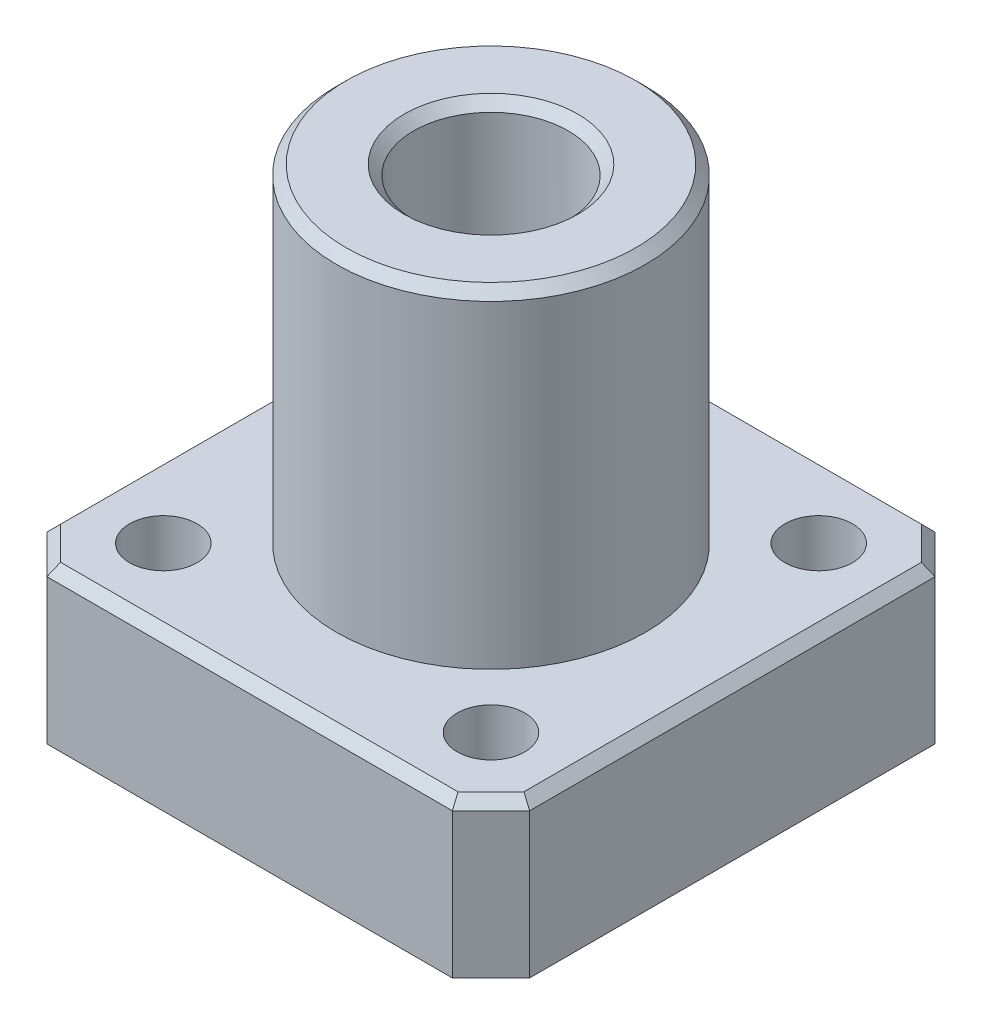
ISO-10303-21;
HEADER;
FILE_DESCRIPTION(('STEP AP214'),'2;1');
FILE_NAME('part.step','',(''),(''),'','','');
FILE_SCHEMA(('AUTOMOTIVE_DESIGN { 1 0 10303 214 1 1 1 1 }'));
ENDSEC;
DATA;
#1=APPLICATION_CONTEXT('core data for automotive mechanical design processes');
#2=APPLICATION_PROTOCOL_DEFINITION('international standard','automotive_design',2000,#1);
#3=PRODUCT_CONTEXT('',#1,'mechanical');
#4=PRODUCT('Part','Part','',(#3));
#5=PRODUCT_RELATED_PRODUCT_CATEGORY('part','',(#4));
#6=PRODUCT_DEFINITION_FORMATION('','',#4);
#7=PRODUCT_DEFINITION_CONTEXT('part definition',#1,'design');
#8=PRODUCT_DEFINITION('design','',#6,#7);
#9=PRODUCT_DEFINITION_SHAPE('','',#8);
#10=(LENGTH_UNIT() NAMED_UNIT(*) SI_UNIT(.MILLI.,.METRE.));
#11=(NAMED_UNIT(*) PLANE_ANGLE_UNIT() SI_UNIT($,.RADIAN.));
#12=(NAMED_UNIT(*) SI_UNIT($,.STERADIAN.) SOLID_ANGLE_UNIT());
#13=UNCERTAINTY_MEASURE_WITH_UNIT(LENGTH_MEASURE(1.E-05),#10,'distance_accuracy_value','');
#14=(GEOMETRIC_REPRESENTATION_CONTEXT(3) GLOBAL_UNCERTAINTY_ASSIGNED_CONTEXT((#13)) GLOBAL_UNIT_ASSIGNED_CONTEXT((#10,
#11,#12)) REPRESENTATION_CONTEXT('',''));
#15=CARTESIAN_POINT('',(0.,0.,0.));
#16=DIRECTION('',(0.,0.,1.));
#17=DIRECTION('',(1.,0.,0.));
#18=AXIS2_PLACEMENT_3D('',#15,#16,#17);
#19=CARTESIAN_POINT('',(0.,8.,-25.));
#20=DIRECTION('',(0.,-1.,0.));
#21=DIRECTION('',(0.,0.,-1.));
#22=AXIS2_PLACEMENT_3D('',#19,#20,#21);
#23=PLANE('',#22);
#24=DIRECTION('',(0.,0.,-1.));
#25=VECTOR('',#24,1.);
#26=CARTESIAN_POINT('',(24.5,8.,-25.));
#27=LINE('',#26,#25);
#28=CARTESIAN_POINT('',(24.5,8.,-2.20710678118656));
#29=VERTEX_POINT('',#28);
#30=CARTESIAN_POINT('',(24.5,8.,-22.7928932188134));
#31=VERTEX_POINT('',#30);
#32=EDGE_CURVE('E206',#29,#31,#27,.T.);
#33=ORIENTED_EDGE('',*,*,#32,.T.);
#34=DIRECTION('',(-0.707106781186547,0.,-0.707106781186548));
#35=VECTOR('',#34,1.);
#36=CARTESIAN_POINT('',(22.6464466094067,8.,-24.6464466094067));
#37=LINE('',#36,#35);
#38=CARTESIAN_POINT('',(22.7928932188134,8.,-24.5));
#39=VERTEX_POINT('',#38);
#40=EDGE_CURVE('E208',#31,#39,#37,.T.);
#41=ORIENTED_EDGE('',*,*,#40,.T.);
#42=DIRECTION('',(-1.,0.,0.));
#43=VECTOR('',#42,1.);
#44=CARTESIAN_POINT('',(0.,8.,-24.5));
#45=LINE('',#44,#43);
#46=CARTESIAN_POINT('',(2.20710678118656,8.,-24.5));
#47=VERTEX_POINT('',#46);
#48=EDGE_CURVE('E198',#39,#47,#45,.T.);
#49=ORIENTED_EDGE('',*,*,#48,.T.);
#50=DIRECTION('',(-0.707106781186548,0.,0.707106781186547));
#51=VECTOR('',#50,1.);
#52=CARTESIAN_POINT('',(0.353553390593274,8.,-22.6464466094067));
#53=LINE('',#52,#51);
#54=CARTESIAN_POINT('',(0.5,8.,-22.7928932188134));
#55=VERTEX_POINT('',#54);
#56=EDGE_CURVE('E196',#47,#55,#53,.T.);
#57=ORIENTED_EDGE('',*,*,#56,.T.);
#58=DIRECTION('',(0.,0.,1.));
#59=VECTOR('',#58,1.);
#60=CARTESIAN_POINT('',(0.5,8.,-25.));
#61=LINE('',#60,#59);
#62=CARTESIAN_POINT('',(0.5,8.,-2.20710678118656));
#63=VERTEX_POINT('',#62);
#64=EDGE_CURVE('E194',#55,#63,#61,.T.);
#65=ORIENTED_EDGE('',*,*,#64,.T.);
#66=DIRECTION('',(0.707106781186547,0.,0.707106781186548));
#67=VECTOR('',#66,1.);
#68=CARTESIAN_POINT('',(2.35355339059328,8.,-0.353553390593274));
#69=LINE('',#68,#67);
#70=CARTESIAN_POINT('',(2.20710678118656,8.,-0.500000000000001));
#71=VERTEX_POINT('',#70);
#72=EDGE_CURVE('E200',#63,#71,#69,.T.);
#73=ORIENTED_EDGE('',*,*,#72,.T.);
#74=DIRECTION('',(1.,0.,0.));
#75=VECTOR('',#74,1.);
#76=CARTESIAN_POINT('',(0.,8.,-0.5));
#77=LINE('',#76,#75);
#78=CARTESIAN_POINT('',(22.7928932188134,8.,-0.5));
#79=VERTEX_POINT('',#78);
#80=EDGE_CURVE('E202',#71,#79,#77,.T.);
#81=ORIENTED_EDGE('',*,*,#80,.T.);
#82=DIRECTION('',(0.707106781186548,0.,-0.707106781186547));
#83=VECTOR('',#82,1.);
#84=CARTESIAN_POINT('',(24.6464466094067,8.,-2.35355339059329));
#85=LINE('',#84,#83);
#86=EDGE_CURVE('E204',#79,#29,#85,.T.);
#87=ORIENTED_EDGE('',*,*,#86,.T.);
#88=EDGE_LOOP('',(#33,#41,#49,#57,#65,#73,#81,#87));
#89=FACE_BOUND('',#88,.T.);
#90=CARTESIAN_POINT('',(4.01471862576143,8.,-4.01471862576143));
#91=DIRECTION('',(0.,1.,0.));
#92=DIRECTION('',(0.,0.,-1.));
#93=AXIS2_PLACEMENT_3D('',#90,#91,#92);
#94=CIRCLE('',#93,1.75);
#95=CARTESIAN_POINT('',(4.01471862576143,8.,-5.76471862576143));
#96=VERTEX_POINT('',#95);
#97=EDGE_CURVE('E252',#96,#96,#94,.T.);
#98=ORIENTED_EDGE('',*,*,#97,.F.);
#99=EDGE_LOOP('',(#98));
#100=FACE_BOUND('',#99,.T.);
#101=CARTESIAN_POINT('',(20.9852813742386,8.,-20.9852813742386));
#102=DIRECTION('',(0.,1.,0.));
#103=DIRECTION('',(0.,0.,-1.));
#104=AXIS2_PLACEMENT_3D('',#101,#102,#103);
#105=CIRCLE('',#104,1.75);
#106=CARTESIAN_POINT('',(20.9852813742386,8.,-22.7352813742386));
#107=VERTEX_POINT('',#106);
#108=EDGE_CURVE('E266',#107,#107,#105,.T.);
#109=ORIENTED_EDGE('',*,*,#108,.F.);
#110=EDGE_LOOP('',(#109));
#111=FACE_BOUND('',#110,.T.);
#112=CARTESIAN_POINT('',(4.01471862576143,8.,-20.9852813742386));
#113=DIRECTION('',(0.,1.,0.));
#114=DIRECTION('',(0.,0.,1.));
#115=AXIS2_PLACEMENT_3D('',#112,#113,#114);
#116=CIRCLE('',#115,1.75);
#117=CARTESIAN_POINT('',(4.01471862576143,8.,-19.2352813742386));
#118=VERTEX_POINT('',#117);
#119=EDGE_CURVE('E142',#118,#118,#116,.T.);
#120=ORIENTED_EDGE('',*,*,#119,.F.);
#121=EDGE_LOOP('',(#120));
#122=FACE_BOUND('',#121,.T.);
#123=CARTESIAN_POINT('',(20.9852813742386,8.,-4.01471862576143));
#124=DIRECTION('',(0.,1.,0.));
#125=DIRECTION('',(0.,0.,1.));
#126=AXIS2_PLACEMENT_3D('',#123,#124,#125);
#127=CIRCLE('',#126,1.75);
#128=CARTESIAN_POINT('',(20.9852813742386,8.,-2.26471862576143));
#129=VERTEX_POINT('',#128);
#130=EDGE_CURVE('E260',#129,#129,#127,.T.);
#131=ORIENTED_EDGE('',*,*,#130,.F.);
#132=EDGE_LOOP('',(#131));
#133=FACE_BOUND('',#132,.T.);
#134=CARTESIAN_POINT('',(12.5,8.,-12.5));
#135=DIRECTION('',(0.,-1.,0.));
#136=DIRECTION('',(0.,0.,-1.));
#137=AXIS2_PLACEMENT_3D('',#134,#135,#136);
#138=CIRCLE('',#137,8.);
#139=CARTESIAN_POINT('',(12.5,8.,-20.5));
#140=VERTEX_POINT('',#139);
#141=EDGE_CURVE('E156',#140,#140,#138,.F.);
#142=ORIENTED_EDGE('',*,*,#141,.F.);
#143=EDGE_LOOP('',(#142));
#144=FACE_BOUND('',#143,.T.);
#145=ADVANCED_FACE('F30',(#89,#100,#111,#122,#133,#144),#23,.F.);
#146=CARTESIAN_POINT('',(0.,0.,-25.));
#147=DIRECTION('',(0.,-1.,0.));
#148=DIRECTION('',(0.,0.,-1.));
#149=AXIS2_PLACEMENT_3D('',#146,#147,#148);
#150=PLANE('',#149);
#151=CARTESIAN_POINT('',(12.5,0.,-12.5));
#152=DIRECTION('',(0.,-1.,0.));
#153=DIRECTION('',(0.,0.,-1.));
#154=AXIS2_PLACEMENT_3D('',#151,#152,#153);
#155=CIRCLE('',#154,4.50000000000001);
#156=CARTESIAN_POINT('',(12.5,0.,-17.));
#157=VERTEX_POINT('',#156);
#158=EDGE_CURVE('E191',#157,#157,#155,.F.);
#159=ORIENTED_EDGE('',*,*,#158,.T.);
#160=EDGE_LOOP('',(#159));
#161=FACE_BOUND('',#160,.T.);
#162=CARTESIAN_POINT('',(20.9852813742386,0.,-4.01471862576143));
#163=DIRECTION('',(0.,1.,0.));
#164=DIRECTION('',(0.,0.,1.));
#165=AXIS2_PLACEMENT_3D('',#162,#163,#164);
#166=CIRCLE('',#165,1.75);
#167=CARTESIAN_POINT('',(20.9852813742386,0.,-2.26471862576143));
#168=VERTEX_POINT('',#167);
#169=EDGE_CURVE('E257',#168,#168,#166,.T.);
#170=ORIENTED_EDGE('',*,*,#169,.T.);
#171=EDGE_LOOP('',(#170));
#172=FACE_BOUND('',#171,.T.);
#173=CARTESIAN_POINT('',(4.01471862576143,0.,-20.9852813742386));
#174=DIRECTION('',(0.,1.,0.));
#175=DIRECTION('',(0.,0.,1.));
#176=AXIS2_PLACEMENT_3D('',#173,#174,#175);
#177=CIRCLE('',#176,1.75);
#178=CARTESIAN_POINT('',(4.01471862576143,0.,-19.2352813742386));
#179=VERTEX_POINT('',#178);
#180=EDGE_CURVE('E148',#179,#179,#177,.T.);
#181=ORIENTED_EDGE('',*,*,#180,.T.);
#182=EDGE_LOOP('',(#181));
#183=FACE_BOUND('',#182,.T.);
#184=DIRECTION('',(0.,0.,1.));
#185=VECTOR('',#184,1.);
#186=CARTESIAN_POINT('',(0.,0.,0.));
#187=LINE('',#186,#185);
#188=CARTESIAN_POINT('',(0.,0.,-23.));
#189=VERTEX_POINT('',#188);
#190=CARTESIAN_POINT('',(0.,0.,-2.00000000000001));
#191=VERTEX_POINT('',#190);
#192=EDGE_CURVE('E122',#189,#191,#187,.T.);
#193=ORIENTED_EDGE('',*,*,#192,.F.);
#194=DIRECTION('',(-0.707106781186548,0.,0.707106781186547));
#195=VECTOR('',#194,1.);
#196=CARTESIAN_POINT('',(1.,0.,-24.));
#197=LINE('',#196,#195);
#198=CARTESIAN_POINT('',(2.00000000000001,0.,-25.));
#199=VERTEX_POINT('',#198);
#200=EDGE_CURVE('E128',#189,#199,#197,.F.);
#201=ORIENTED_EDGE('',*,*,#200,.T.);
#202=DIRECTION('',(-1.,0.,0.));
#203=VECTOR('',#202,1.);
#204=CARTESIAN_POINT('',(0.,0.,-25.));
#205=LINE('',#204,#203);
#206=CARTESIAN_POINT('',(23.,0.,-25.));
#207=VERTEX_POINT('',#206);
#208=EDGE_CURVE('E154',#207,#199,#205,.T.);
#209=ORIENTED_EDGE('',*,*,#208,.F.);
#210=DIRECTION('',(-0.707106781186547,0.,-0.707106781186548));
#211=VECTOR('',#210,1.);
#212=CARTESIAN_POINT('',(11.5,0.,-36.5));
#213=LINE('',#212,#211);
#214=CARTESIAN_POINT('',(25.,0.,-23.));
#215=VERTEX_POINT('',#214);
#216=EDGE_CURVE('E135',#207,#215,#213,.F.);
#217=ORIENTED_EDGE('',*,*,#216,.T.);
#218=DIRECTION('',(0.,0.,-1.));
#219=VECTOR('',#218,1.);
#220=CARTESIAN_POINT('',(25.,0.,0.));
#221=LINE('',#220,#219);
#222=CARTESIAN_POINT('',(25.,0.,-2.00000000000001));
#223=VERTEX_POINT('',#222);
#224=EDGE_CURVE('E145',#223,#215,#221,.T.);
#225=ORIENTED_EDGE('',*,*,#224,.F.);
#226=DIRECTION('',(0.707106781186548,0.,-0.707106781186547));
#227=VECTOR('',#226,1.);
#228=CARTESIAN_POINT('',(24.,0.,-0.999999999999987));
#229=LINE('',#228,#227);
#230=CARTESIAN_POINT('',(23.,0.,0.));
#231=VERTEX_POINT('',#230);
#232=EDGE_CURVE('E161',#223,#231,#229,.F.);
#233=ORIENTED_EDGE('',*,*,#232,.T.);
#234=DIRECTION('',(1.,0.,0.));
#235=VECTOR('',#234,1.);
#236=CARTESIAN_POINT('',(0.,0.,0.));
#237=LINE('',#236,#235);
#238=CARTESIAN_POINT('',(2.00000000000001,0.,0.));
#239=VERTEX_POINT('',#238);
#240=EDGE_CURVE('E141',#239,#231,#237,.T.);
#241=ORIENTED_EDGE('',*,*,#240,.F.);
#242=DIRECTION('',(0.707106781186547,0.,0.707106781186548));
#243=VECTOR('',#242,1.);
#244=CARTESIAN_POINT('',(-11.5,0.,-13.5));
#245=LINE('',#244,#243);
#246=EDGE_CURVE('E125',#239,#191,#245,.F.);
#247=ORIENTED_EDGE('',*,*,#246,.T.);
#248=EDGE_LOOP('',(#193,#201,#209,#217,#225,#233,#241,#247));
#249=FACE_BOUND('',#248,.T.);
#250=CARTESIAN_POINT('',(20.9852813742386,0.,-20.9852813742386));
#251=DIRECTION('',(0.,1.,0.));
#252=DIRECTION('',(0.,0.,-1.));
#253=AXIS2_PLACEMENT_3D('',#250,#251,#252);
#254=CIRCLE('',#253,1.75);
#255=CARTESIAN_POINT('',(20.9852813742386,0.,-22.7352813742386));
#256=VERTEX_POINT('',#255);
#257=EDGE_CURVE('E263',#256,#256,#254,.T.);
#258=ORIENTED_EDGE('',*,*,#257,.T.);
#259=EDGE_LOOP('',(#258));
#260=FACE_BOUND('',#259,.T.);
#261=CARTESIAN_POINT('',(4.01471862576143,0.,-4.01471862576143));
#262=DIRECTION('',(0.,1.,0.));
#263=DIRECTION('',(0.,0.,-1.));
#264=AXIS2_PLACEMENT_3D('',#261,#262,#263);
#265=CIRCLE('',#264,1.75);
#266=CARTESIAN_POINT('',(4.01471862576143,0.,-5.76471862576143));
#267=VERTEX_POINT('',#266);
#268=EDGE_CURVE('E246',#267,#267,#265,.T.);
#269=ORIENTED_EDGE('',*,*,#268,.T.);
#270=EDGE_LOOP('',(#269));
#271=FACE_BOUND('',#270,.T.);
#272=ADVANCED_FACE('F137',(#161,#172,#183,#249,#260,#271),#150,.T.);
#273=CARTESIAN_POINT('',(0.,8.,0.));
#274=DIRECTION('',(1.,0.,0.));
#275=DIRECTION('',(0.,0.,-1.));
#276=AXIS2_PLACEMENT_3D('',#273,#274,#275);
#277=PLANE('',#276);
#278=DIRECTION('',(0.,1.,0.));
#279=VECTOR('',#278,1.);
#280=CARTESIAN_POINT('',(0.,8.,-2.00000000000001));
#281=LINE('',#280,#279);
#282=CARTESIAN_POINT('',(0.,7.5,-2.00000000000001));
#283=VERTEX_POINT('',#282);
#284=EDGE_CURVE('E126',#191,#283,#281,.T.);
#285=ORIENTED_EDGE('',*,*,#284,.T.);
#286=DIRECTION('',(0.,0.,-1.));
#287=VECTOR('',#286,1.);
#288=CARTESIAN_POINT('',(0.,7.5,0.));
#289=LINE('',#288,#287);
#290=CARTESIAN_POINT('',(0.,7.5,-23.));
#291=VERTEX_POINT('',#290);
#292=EDGE_CURVE('E11',#283,#291,#289,.T.);
#293=ORIENTED_EDGE('',*,*,#292,.T.);
#294=DIRECTION('',(0.,-1.,0.));
#295=VECTOR('',#294,1.);
#296=CARTESIAN_POINT('',(0.,8.,-23.));
#297=LINE('',#296,#295);
#298=EDGE_CURVE('E118',#291,#189,#297,.T.);
#299=ORIENTED_EDGE('',*,*,#298,.T.);
#300=ORIENTED_EDGE('',*,*,#192,.T.);
#301=EDGE_LOOP('',(#285,#293,#299,#300));
#302=FACE_BOUND('',#301,.T.);
#303=ADVANCED_FACE('F120',(#302),#277,.F.);
#304=CARTESIAN_POINT('',(0.,8.,0.));
#305=DIRECTION('',(0.,0.,-1.));
#306=DIRECTION('',(-1.,0.,0.));
#307=AXIS2_PLACEMENT_3D('',#304,#305,#306);
#308=PLANE('',#307);
#309=DIRECTION('',(0.,1.,0.));
#310=VECTOR('',#309,1.);
#311=CARTESIAN_POINT('',(23.,8.,0.));
#312=LINE('',#311,#310);
#313=CARTESIAN_POINT('',(23.,7.5,0.));
#314=VERTEX_POINT('',#313);
#315=EDGE_CURVE('E173',#231,#314,#312,.T.);
#316=ORIENTED_EDGE('',*,*,#315,.T.);
#317=DIRECTION('',(-1.,0.,0.));
#318=VECTOR('',#317,1.);
#319=CARTESIAN_POINT('',(0.,7.5,0.));
#320=LINE('',#319,#318);
#321=CARTESIAN_POINT('',(2.00000000000001,7.5,0.));
#322=VERTEX_POINT('',#321);
#323=EDGE_CURVE('E218',#314,#322,#320,.T.);
#324=ORIENTED_EDGE('',*,*,#323,.T.);
#325=DIRECTION('',(0.,-1.,0.));
#326=VECTOR('',#325,1.);
#327=CARTESIAN_POINT('',(2.00000000000001,8.,0.));
#328=LINE('',#327,#326);
#329=EDGE_CURVE('E171',#322,#239,#328,.T.);
#330=ORIENTED_EDGE('',*,*,#329,.T.);
#331=ORIENTED_EDGE('',*,*,#240,.T.);
#332=EDGE_LOOP('',(#316,#324,#330,#331));
#333=FACE_BOUND('',#332,.T.);
#334=ADVANCED_FACE('F304',(#333),#308,.F.);
#335=CARTESIAN_POINT('',(25.,8.,0.));
#336=DIRECTION('',(-1.,0.,0.));
#337=DIRECTION('',(0.,0.,1.));
#338=AXIS2_PLACEMENT_3D('',#335,#336,#337);
#339=PLANE('',#338);
#340=DIRECTION('',(0.,1.,0.));
#341=VECTOR('',#340,1.);
#342=CARTESIAN_POINT('',(25.,8.,-23.));
#343=LINE('',#342,#341);
#344=CARTESIAN_POINT('',(25.,7.5,-23.));
#345=VERTEX_POINT('',#344);
#346=EDGE_CURVE('E168',#215,#345,#343,.T.);
#347=ORIENTED_EDGE('',*,*,#346,.T.);
#348=DIRECTION('',(0.,0.,1.));
#349=VECTOR('',#348,1.);
#350=CARTESIAN_POINT('',(25.,7.5,0.));
#351=LINE('',#350,#349);
#352=CARTESIAN_POINT('',(25.,7.5,-2.00000000000001));
#353=VERTEX_POINT('',#352);
#354=EDGE_CURVE('E214',#345,#353,#351,.T.);
#355=ORIENTED_EDGE('',*,*,#354,.T.);
#356=DIRECTION('',(0.,-1.,0.));
#357=VECTOR('',#356,1.);
#358=CARTESIAN_POINT('',(25.,8.,-2.00000000000001));
#359=LINE('',#358,#357);
#360=EDGE_CURVE('E166',#353,#223,#359,.T.);
#361=ORIENTED_EDGE('',*,*,#360,.T.);
#362=ORIENTED_EDGE('',*,*,#224,.T.);
#363=EDGE_LOOP('',(#347,#355,#361,#362));
#364=FACE_BOUND('',#363,.T.);
#365=ADVANCED_FACE('F300',(#364),#339,.F.);
#366=CARTESIAN_POINT('',(0.,8.,-25.));
#367=DIRECTION('',(0.,0.,1.));
#368=DIRECTION('',(1.,0.,0.));
#369=AXIS2_PLACEMENT_3D('',#366,#367,#368);
#370=PLANE('',#369);
#371=DIRECTION('',(0.,1.,0.));
#372=VECTOR('',#371,1.);
#373=CARTESIAN_POINT('',(2.00000000000001,8.,-25.));
#374=LINE('',#373,#372);
#375=CARTESIAN_POINT('',(2.00000000000001,7.5,-25.));
#376=VERTEX_POINT('',#375);
#377=EDGE_CURVE('E130',#199,#376,#374,.T.);
#378=ORIENTED_EDGE('',*,*,#377,.T.);
#379=DIRECTION('',(1.,0.,0.));
#380=VECTOR('',#379,1.);
#381=CARTESIAN_POINT('',(0.,7.5,-25.));
#382=LINE('',#381,#380);
#383=CARTESIAN_POINT('',(23.,7.5,-25.));
#384=VERTEX_POINT('',#383);
#385=EDGE_CURVE('E222',#376,#384,#382,.T.);
#386=ORIENTED_EDGE('',*,*,#385,.T.);
#387=DIRECTION('',(0.,-1.,0.));
#388=VECTOR('',#387,1.);
#389=CARTESIAN_POINT('',(23.,8.,-25.));
#390=LINE('',#389,#388);
#391=EDGE_CURVE('E134',#384,#207,#390,.T.);
#392=ORIENTED_EDGE('',*,*,#391,.T.);
#393=ORIENTED_EDGE('',*,*,#208,.T.);
#394=EDGE_LOOP('',(#378,#386,#392,#393));
#395=FACE_BOUND('',#394,.T.);
#396=ADVANCED_FACE('F285',(#395),#370,.F.);
#397=CARTESIAN_POINT('',(4.01471862576143,8.,-20.9852813742386));
#398=DIRECTION('',(0.,-1.,0.));
#399=DIRECTION('',(0.,0.,-1.));
#400=AXIS2_PLACEMENT_3D('',#397,#398,#399);
#401=CYLINDRICAL_SURFACE('',#400,1.75);
#402=ORIENTED_EDGE('',*,*,#119,.T.);
#403=EDGE_LOOP('',(#402));
#404=FACE_BOUND('',#403,.T.);
#405=ORIENTED_EDGE('',*,*,#180,.F.);
#406=EDGE_LOOP('',(#405));
#407=FACE_BOUND('',#406,.T.);
#408=ADVANCED_FACE('F275',(#404,#407),#401,.F.);
#409=CARTESIAN_POINT('',(20.9852813742386,8.,-20.9852813742386));
#410=DIRECTION('',(0.,-1.,0.));
#411=DIRECTION('',(0.,0.,-1.));
#412=AXIS2_PLACEMENT_3D('',#409,#410,#411);
#413=CYLINDRICAL_SURFACE('',#412,1.75);
#414=ORIENTED_EDGE('',*,*,#108,.T.);
#415=EDGE_LOOP('',(#414));
#416=FACE_BOUND('',#415,.T.);
#417=ORIENTED_EDGE('',*,*,#257,.F.);
#418=EDGE_LOOP('',(#417));
#419=FACE_BOUND('',#418,.T.);
#420=ADVANCED_FACE('F272',(#416,#419),#413,.F.);
#421=CARTESIAN_POINT('',(20.9852813742386,8.,-4.01471862576143));
#422=DIRECTION('',(0.,-1.,0.));
#423=DIRECTION('',(0.,0.,-1.));
#424=AXIS2_PLACEMENT_3D('',#421,#422,#423);
#425=CYLINDRICAL_SURFACE('',#424,1.75);
#426=ORIENTED_EDGE('',*,*,#130,.T.);
#427=EDGE_LOOP('',(#426));
#428=FACE_BOUND('',#427,.T.);
#429=ORIENTED_EDGE('',*,*,#169,.F.);
#430=EDGE_LOOP('',(#429));
#431=FACE_BOUND('',#430,.T.);
#432=ADVANCED_FACE('F274',(#428,#431),#425,.F.);
#433=CARTESIAN_POINT('',(4.01471862576143,8.,-4.01471862576143));
#434=DIRECTION('',(0.,-1.,0.));
#435=DIRECTION('',(0.,0.,-1.));
#436=AXIS2_PLACEMENT_3D('',#433,#434,#435);
#437=CYLINDRICAL_SURFACE('',#436,1.75);
#438=ORIENTED_EDGE('',*,*,#97,.T.);
#439=EDGE_LOOP('',(#438));
#440=FACE_BOUND('',#439,.T.);
#441=ORIENTED_EDGE('',*,*,#268,.F.);
#442=EDGE_LOOP('',(#441));
#443=FACE_BOUND('',#442,.T.);
#444=ADVANCED_FACE('F282',(#440,#443),#437,.F.);
#445=CARTESIAN_POINT('',(12.5,25.,-12.5));
#446=DIRECTION('',(0.,-1.,0.));
#447=DIRECTION('',(0.,0.,-1.));
#448=AXIS2_PLACEMENT_3D('',#445,#446,#447);
#449=CYLINDRICAL_SURFACE('',#448,8.);
#450=CARTESIAN_POINT('',(12.5,24.5,-12.5));
#451=DIRECTION('',(0.,1.,0.));
#452=DIRECTION('',(0.,0.,1.));
#453=AXIS2_PLACEMENT_3D('',#450,#451,#452);
#454=CIRCLE('',#453,8.);
#455=CARTESIAN_POINT('',(12.5,24.5,-4.5));
#456=VERTEX_POINT('',#455);
#457=EDGE_CURVE('E182',#456,#456,#454,.F.);
#458=ORIENTED_EDGE('',*,*,#457,.T.);
#459=EDGE_LOOP('',(#458));
#460=FACE_BOUND('',#459,.T.);
#461=ORIENTED_EDGE('',*,*,#141,.T.);
#462=EDGE_LOOP('',(#461));
#463=FACE_BOUND('',#462,.T.);
#464=ADVANCED_FACE('F434',(#460,#463),#449,.T.);
#465=CARTESIAN_POINT('',(12.5,25.,-12.5));
#466=DIRECTION('',(0.,1.,0.));
#467=DIRECTION('',(0.,0.,1.));
#468=AXIS2_PLACEMENT_3D('',#465,#466,#467);
#469=PLANE('',#468);
#470=CARTESIAN_POINT('',(12.5,25.,-12.5));
#471=DIRECTION('',(0.,1.,0.));
#472=DIRECTION('',(0.,0.,1.));
#473=AXIS2_PLACEMENT_3D('',#470,#471,#472);
#474=CIRCLE('',#473,7.5);
#475=CARTESIAN_POINT('',(12.5,25.,-5.));
#476=VERTEX_POINT('',#475);
#477=EDGE_CURVE('E179',#476,#476,#474,.T.);
#478=ORIENTED_EDGE('',*,*,#477,.T.);
#479=EDGE_LOOP('',(#478));
#480=FACE_BOUND('',#479,.T.);
#481=CARTESIAN_POINT('',(12.5,25.,-12.5));
#482=DIRECTION('',(0.,1.,0.));
#483=DIRECTION('',(0.,0.,1.));
#484=AXIS2_PLACEMENT_3D('',#481,#482,#483);
#485=CIRCLE('',#484,4.50000000000002);
#486=CARTESIAN_POINT('',(12.5,25.,-7.99999999999999));
#487=VERTEX_POINT('',#486);
#488=EDGE_CURVE('E176',#487,#487,#485,.F.);
#489=ORIENTED_EDGE('',*,*,#488,.T.);
#490=EDGE_LOOP('',(#489));
#491=FACE_BOUND('',#490,.T.);
#492=ADVANCED_FACE('F314',(#480,#491),#469,.T.);
#493=CARTESIAN_POINT('',(0.,8.,-23.));
#494=DIRECTION('',(0.707106781186547,0.,0.707106781186548));
#495=DIRECTION('',(0.707106781186548,0.,-0.707106781186547));
#496=AXIS2_PLACEMENT_3D('',#493,#494,#495);
#497=PLANE('',#496);
#498=ORIENTED_EDGE('',*,*,#298,.F.);
#499=DIRECTION('',(-0.707106781186548,0.,0.707106781186547));
#500=VECTOR('',#499,1.);
#501=CARTESIAN_POINT('',(2.00000000000001,7.5,-25.));
#502=LINE('',#501,#500);
#503=EDGE_CURVE('E39',#291,#376,#502,.F.);
#504=ORIENTED_EDGE('',*,*,#503,.T.);
#505=ORIENTED_EDGE('',*,*,#377,.F.);
#506=ORIENTED_EDGE('',*,*,#200,.F.);
#507=EDGE_LOOP('',(#498,#504,#505,#506));
#508=FACE_BOUND('',#507,.T.);
#509=ADVANCED_FACE('F129',(#508),#497,.F.);
#510=CARTESIAN_POINT('',(23.,8.,-25.));
#511=DIRECTION('',(-0.707106781186548,0.,0.707106781186547));
#512=DIRECTION('',(0.707106781186547,0.,0.707106781186548));
#513=AXIS2_PLACEMENT_3D('',#510,#511,#512);
#514=PLANE('',#513);
#515=ORIENTED_EDGE('',*,*,#391,.F.);
#516=DIRECTION('',(-0.707106781186547,0.,-0.707106781186548));
#517=VECTOR('',#516,1.);
#518=CARTESIAN_POINT('',(25.,7.5,-23.));
#519=LINE('',#518,#517);
#520=EDGE_CURVE('E211',#384,#345,#519,.F.);
#521=ORIENTED_EDGE('',*,*,#520,.T.);
#522=ORIENTED_EDGE('',*,*,#346,.F.);
#523=ORIENTED_EDGE('',*,*,#216,.F.);
#524=EDGE_LOOP('',(#515,#521,#522,#523));
#525=FACE_BOUND('',#524,.T.);
#526=ADVANCED_FACE('F313',(#525),#514,.F.);
#527=CARTESIAN_POINT('',(25.,8.,-2.00000000000001));
#528=DIRECTION('',(-0.707106781186547,0.,-0.707106781186548));
#529=DIRECTION('',(-0.707106781186548,0.,0.707106781186547));
#530=AXIS2_PLACEMENT_3D('',#527,#528,#529);
#531=PLANE('',#530);
#532=ORIENTED_EDGE('',*,*,#360,.F.);
#533=DIRECTION('',(0.707106781186548,0.,-0.707106781186547));
#534=VECTOR('',#533,1.);
#535=CARTESIAN_POINT('',(23.,7.5,0.));
#536=LINE('',#535,#534);
#537=EDGE_CURVE('E216',#353,#314,#536,.F.);
#538=ORIENTED_EDGE('',*,*,#537,.T.);
#539=ORIENTED_EDGE('',*,*,#315,.F.);
#540=ORIENTED_EDGE('',*,*,#232,.F.);
#541=EDGE_LOOP('',(#532,#538,#539,#540));
#542=FACE_BOUND('',#541,.T.);
#543=ADVANCED_FACE('F317',(#542),#531,.F.);
#544=CARTESIAN_POINT('',(2.00000000000001,8.,0.));
#545=DIRECTION('',(0.707106781186548,0.,-0.707106781186547));
#546=DIRECTION('',(-0.707106781186547,0.,-0.707106781186548));
#547=AXIS2_PLACEMENT_3D('',#544,#545,#546);
#548=PLANE('',#547);
#549=ORIENTED_EDGE('',*,*,#329,.F.);
#550=DIRECTION('',(0.707106781186547,0.,0.707106781186548));
#551=VECTOR('',#550,1.);
#552=CARTESIAN_POINT('',(0.,7.5,-2.00000000000001));
#553=LINE('',#552,#551);
#554=EDGE_CURVE('E220',#322,#283,#553,.F.);
#555=ORIENTED_EDGE('',*,*,#554,.T.);
#556=ORIENTED_EDGE('',*,*,#284,.F.);
#557=ORIENTED_EDGE('',*,*,#246,.F.);
#558=EDGE_LOOP('',(#549,#555,#556,#557));
#559=FACE_BOUND('',#558,.T.);
#560=ADVANCED_FACE('F321',(#559),#548,.F.);
#561=CARTESIAN_POINT('',(12.5,-0.001000000000001,-12.5));
#562=DIRECTION('',(0.,1.,0.));
#563=DIRECTION('',(0.,0.,1.));
#564=AXIS2_PLACEMENT_3D('',#561,#562,#563);
#565=CYLINDRICAL_SURFACE('',#564,4.);
#566=CARTESIAN_POINT('',(12.5,24.5,-12.5));
#567=DIRECTION('',(0.,1.,0.));
#568=DIRECTION('',(0.,0.,1.));
#569=AXIS2_PLACEMENT_3D('',#566,#567,#568);
#570=CIRCLE('',#569,4.);
#571=CARTESIAN_POINT('',(12.5,24.5,-8.5));
#572=VERTEX_POINT('',#571);
#573=EDGE_CURVE('E188',#572,#572,#570,.T.);
#574=ORIENTED_EDGE('',*,*,#573,.T.);
#575=EDGE_LOOP('',(#574));
#576=FACE_BOUND('',#575,.T.);
#577=CARTESIAN_POINT('',(12.5,0.500000000000007,-12.5));
#578=DIRECTION('',(0.,-1.,0.));
#579=DIRECTION('',(0.,0.,-1.));
#580=AXIS2_PLACEMENT_3D('',#577,#578,#579);
#581=CIRCLE('',#580,4.);
#582=CARTESIAN_POINT('',(12.5,0.500000000000007,-16.5));
#583=VERTEX_POINT('',#582);
#584=EDGE_CURVE('E185',#583,#583,#581,.T.);
#585=ORIENTED_EDGE('',*,*,#584,.T.);
#586=EDGE_LOOP('',(#585));
#587=FACE_BOUND('',#586,.T.);
#588=ADVANCED_FACE('F325',(#576,#587),#565,.F.);
#589=CARTESIAN_POINT('',(12.5,25.,-12.5));
#590=DIRECTION('',(0.,-1.,0.));
#591=DIRECTION('',(0.,0.,-1.));
#592=AXIS2_PLACEMENT_3D('',#589,#590,#591);
#593=CONICAL_SURFACE('',#592,7.5,0.785398163397433);
#594=ORIENTED_EDGE('',*,*,#457,.F.);
#595=EDGE_LOOP('',(#594));
#596=FACE_BOUND('',#595,.T.);
#597=ORIENTED_EDGE('',*,*,#477,.F.);
#598=EDGE_LOOP('',(#597));
#599=FACE_BOUND('',#598,.T.);
#600=ADVANCED_FACE('F327',(#596,#599),#593,.T.);
#601=CARTESIAN_POINT('',(12.5,24.5,-12.5));
#602=DIRECTION('',(0.,1.,0.));
#603=DIRECTION('',(0.,0.,1.));
#604=AXIS2_PLACEMENT_3D('',#601,#602,#603);
#605=CONICAL_SURFACE('',#604,4.,0.785398163397459);
#606=ORIENTED_EDGE('',*,*,#488,.F.);
#607=EDGE_LOOP('',(#606));
#608=FACE_BOUND('',#607,.T.);
#609=ORIENTED_EDGE('',*,*,#573,.F.);
#610=EDGE_LOOP('',(#609));
#611=FACE_BOUND('',#610,.T.);
#612=ADVANCED_FACE('F330',(#608,#611),#605,.F.);
#613=CARTESIAN_POINT('',(12.5,0.,-12.5));
#614=DIRECTION('',(0.,-1.,0.));
#615=DIRECTION('',(0.,0.,-1.));
#616=AXIS2_PLACEMENT_3D('',#613,#614,#615);
#617=CONICAL_SURFACE('',#616,4.50000000000001,0.785398163397446);
#618=ORIENTED_EDGE('',*,*,#584,.F.);
#619=EDGE_LOOP('',(#618));
#620=FACE_BOUND('',#619,.T.);
#621=ORIENTED_EDGE('',*,*,#158,.F.);
#622=EDGE_LOOP('',(#621));
#623=FACE_BOUND('',#622,.T.);
#624=ADVANCED_FACE('F334',(#620,#623),#617,.F.);
#625=CARTESIAN_POINT('',(-11.1464466094067,8.,-13.8535533905933));
#626=DIRECTION('',(0.500000000000001,-0.707106781186546,-0.5));
#627=DIRECTION('',(0.816496580927725,0.577350269189628,0.));
#628=AXIS2_PLACEMENT_3D('',#625,#626,#627);
#629=PLANE('',#628);
#630=DIRECTION('',(0.678598344545844,0.678598344545849,-0.281084637714822));
#631=VECTOR('',#630,1.);
#632=CARTESIAN_POINT('',(4.84759781932294,12.347597819323,-4.00794076169383));
#633=LINE('',#632,#631);
#634=EDGE_CURVE('E240',#283,#63,#633,.T.);
#635=ORIENTED_EDGE('',*,*,#634,.F.);
#636=ORIENTED_EDGE('',*,*,#554,.F.);
#637=DIRECTION('',(0.281084637714823,0.678598344545849,-0.678598344545844));
#638=VECTOR('',#637,1.);
#639=CARTESIAN_POINT('',(3.69916601949276,11.6021496489829,-4.10214964898285));
#640=LINE('',#639,#638);
#641=EDGE_CURVE('E34',#71,#322,#640,.F.);
#642=ORIENTED_EDGE('',*,*,#641,.F.);
#643=ORIENTED_EDGE('',*,*,#72,.F.);
#644=EDGE_LOOP('',(#635,#636,#642,#643));
#645=FACE_BOUND('',#644,.T.);
#646=ADVANCED_FACE('F32',(#645),#629,.F.);
#647=CARTESIAN_POINT('',(0.,8.,-0.5));
#648=DIRECTION('',(0.,-0.707106781186545,-0.70710678118655));
#649=DIRECTION('',(0.,0.70710678118655,-0.707106781186545));
#650=AXIS2_PLACEMENT_3D('',#647,#648,#649);
#651=PLANE('',#650);
#652=ORIENTED_EDGE('',*,*,#641,.T.);
#653=ORIENTED_EDGE('',*,*,#323,.F.);
#654=DIRECTION('',(-0.281084637714826,0.678598344545848,-0.678598344545844));
#655=VECTOR('',#654,1.);
#656=CARTESIAN_POINT('',(20.9920592383061,12.347597819323,-4.84759781932299));
#657=LINE('',#656,#655);
#658=EDGE_CURVE('E238',#79,#314,#657,.F.);
#659=ORIENTED_EDGE('',*,*,#658,.F.);
#660=ORIENTED_EDGE('',*,*,#80,.F.);
#661=EDGE_LOOP('',(#652,#653,#659,#660));
#662=FACE_BOUND('',#661,.T.);
#663=ADVANCED_FACE('F361',(#662),#651,.F.);
#664=CARTESIAN_POINT('',(0.5,8.,-25.));
#665=DIRECTION('',(0.70710678118655,-0.707106781186545,0.));
#666=DIRECTION('',(0.707106781186545,0.70710678118655,0.));
#667=AXIS2_PLACEMENT_3D('',#664,#665,#666);
#668=PLANE('',#667);
#669=ORIENTED_EDGE('',*,*,#634,.T.);
#670=ORIENTED_EDGE('',*,*,#64,.F.);
#671=DIRECTION('',(-0.678598344545844,-0.678598344545849,-0.281084637714822));
#672=VECTOR('',#671,1.);
#673=CARTESIAN_POINT('',(0.0790085735592699,7.57900857355927,-22.967273577288));
#674=LINE('',#673,#672);
#675=EDGE_CURVE('E235',#291,#55,#674,.F.);
#676=ORIENTED_EDGE('',*,*,#675,.F.);
#677=ORIENTED_EDGE('',*,*,#292,.F.);
#678=EDGE_LOOP('',(#669,#670,#676,#677));
#679=FACE_BOUND('',#678,.T.);
#680=ADVANCED_FACE('F358',(#679),#668,.F.);
#681=CARTESIAN_POINT('',(23.6464466094067,8.,-1.35355339059326));
#682=DIRECTION('',(-0.499999999999999,-0.707106781186548,-0.5));
#683=DIRECTION('',(0.,0.577350269189626,-0.816496580927726));
#684=AXIS2_PLACEMENT_3D('',#681,#682,#683);
#685=PLANE('',#684);
#686=ORIENTED_EDGE('',*,*,#658,.T.);
#687=ORIENTED_EDGE('',*,*,#537,.F.);
#688=DIRECTION('',(-0.678598344545843,0.678598344545848,-0.281084637714827));
#689=VECTOR('',#688,1.);
#690=CARTESIAN_POINT('',(24.2697521433898,8.23024785661019,-2.30247856610184));
#691=LINE('',#690,#689);
#692=EDGE_CURVE('E232',#29,#353,#691,.F.);
#693=ORIENTED_EDGE('',*,*,#692,.F.);
#694=ORIENTED_EDGE('',*,*,#86,.F.);
#695=EDGE_LOOP('',(#686,#687,#693,#694));
#696=FACE_BOUND('',#695,.T.);
#697=ADVANCED_FACE('F354',(#696),#685,.F.);
#698=CARTESIAN_POINT('',(1.35355339059328,8.,-23.6464466094067));
#699=DIRECTION('',(0.500000000000001,-0.707106781186546,0.500000000000002));
#700=DIRECTION('',(0.,-0.577350269189628,-0.816496580927724));
#701=AXIS2_PLACEMENT_3D('',#698,#699,#700);
#702=PLANE('',#701);
#703=ORIENTED_EDGE('',*,*,#675,.T.);
#704=ORIENTED_EDGE('',*,*,#56,.F.);
#705=DIRECTION('',(-0.281084637714821,-0.678598344545849,-0.678598344545845));
#706=VECTOR('',#705,1.);
#707=CARTESIAN_POINT('',(2.30247856610183,8.23024785661018,-24.2697521433898));
#708=LINE('',#707,#706);
#709=EDGE_CURVE('E229',#376,#47,#708,.F.);
#710=ORIENTED_EDGE('',*,*,#709,.F.);
#711=ORIENTED_EDGE('',*,*,#503,.F.);
#712=EDGE_LOOP('',(#703,#704,#710,#711));
#713=FACE_BOUND('',#712,.T.);
#714=ADVANCED_FACE('F350',(#713),#702,.F.);
#715=CARTESIAN_POINT('',(24.5,8.,-25.));
#716=DIRECTION('',(-0.70710678118655,-0.707106781186545,0.));
#717=DIRECTION('',(0.707106781186545,-0.70710678118655,0.));
#718=AXIS2_PLACEMENT_3D('',#715,#716,#717);
#719=PLANE('',#718);
#720=ORIENTED_EDGE('',*,*,#692,.T.);
#721=ORIENTED_EDGE('',*,*,#354,.F.);
#722=DIRECTION('',(-0.678598344545845,0.67859834454585,0.281084637714819));
#723=VECTOR('',#722,1.);
#724=CARTESIAN_POINT('',(24.9209914264407,7.57900857355927,-22.967273577288));
#725=LINE('',#724,#723);
#726=EDGE_CURVE('E227',#31,#345,#725,.F.);
#727=ORIENTED_EDGE('',*,*,#726,.F.);
#728=ORIENTED_EDGE('',*,*,#32,.F.);
#729=EDGE_LOOP('',(#720,#721,#727,#728));
#730=FACE_BOUND('',#729,.T.);
#731=ADVANCED_FACE('F346',(#730),#719,.F.);
#732=CARTESIAN_POINT('',(0.,8.,-24.5));
#733=DIRECTION('',(0.,-0.707106781186545,0.70710678118655));
#734=DIRECTION('',(0.,-0.70710678118655,-0.707106781186545));
#735=AXIS2_PLACEMENT_3D('',#732,#733,#734);
#736=PLANE('',#735);
#737=ORIENTED_EDGE('',*,*,#709,.T.);
#738=ORIENTED_EDGE('',*,*,#48,.F.);
#739=DIRECTION('',(0.28108463771482,-0.67859834454585,-0.678598344545845));
#740=VECTOR('',#739,1.);
#741=CARTESIAN_POINT('',(20.9920592383062,12.3475978193229,-20.1524021806771));
#742=LINE('',#741,#740);
#743=EDGE_CURVE('E225',#384,#39,#742,.F.);
#744=ORIENTED_EDGE('',*,*,#743,.F.);
#745=ORIENTED_EDGE('',*,*,#385,.F.);
#746=EDGE_LOOP('',(#737,#738,#744,#745));
#747=FACE_BOUND('',#746,.T.);
#748=ADVANCED_FACE('F342',(#747),#736,.F.);
#749=CARTESIAN_POINT('',(11.1464466094067,8.,-36.1464466094067));
#750=DIRECTION('',(-0.500000000000002,-0.707106781186545,0.500000000000001));
#751=DIRECTION('',(0.816496580927724,-0.577350269189629,0.));
#752=AXIS2_PLACEMENT_3D('',#749,#750,#751);
#753=PLANE('',#752);
#754=ORIENTED_EDGE('',*,*,#726,.T.);
#755=ORIENTED_EDGE('',*,*,#520,.F.);
#756=ORIENTED_EDGE('',*,*,#743,.T.);
#757=ORIENTED_EDGE('',*,*,#40,.F.);
#758=EDGE_LOOP('',(#754,#755,#756,#757));
#759=FACE_BOUND('',#758,.T.);
#760=ADVANCED_FACE('F339',(#759),#753,.F.);
#761=CLOSED_SHELL('',(#145,#272,#303,#334,#365,#396,#408,#420,#432,#444,#464,#492,#509,#526,
#543,#560,#588,#600,#612,#624,#646,#663,#680,#697,#714,#731,#748,#760));
#762=MANIFOLD_SOLID_BREP('B2',#761);
#763=ADVANCED_BREP_SHAPE_REPRESENTATION('',(#18,#762),#14);
#764=SHAPE_DEFINITION_REPRESENTATION(#9,#763);
ENDSEC;
END-ISO-10303-21;
